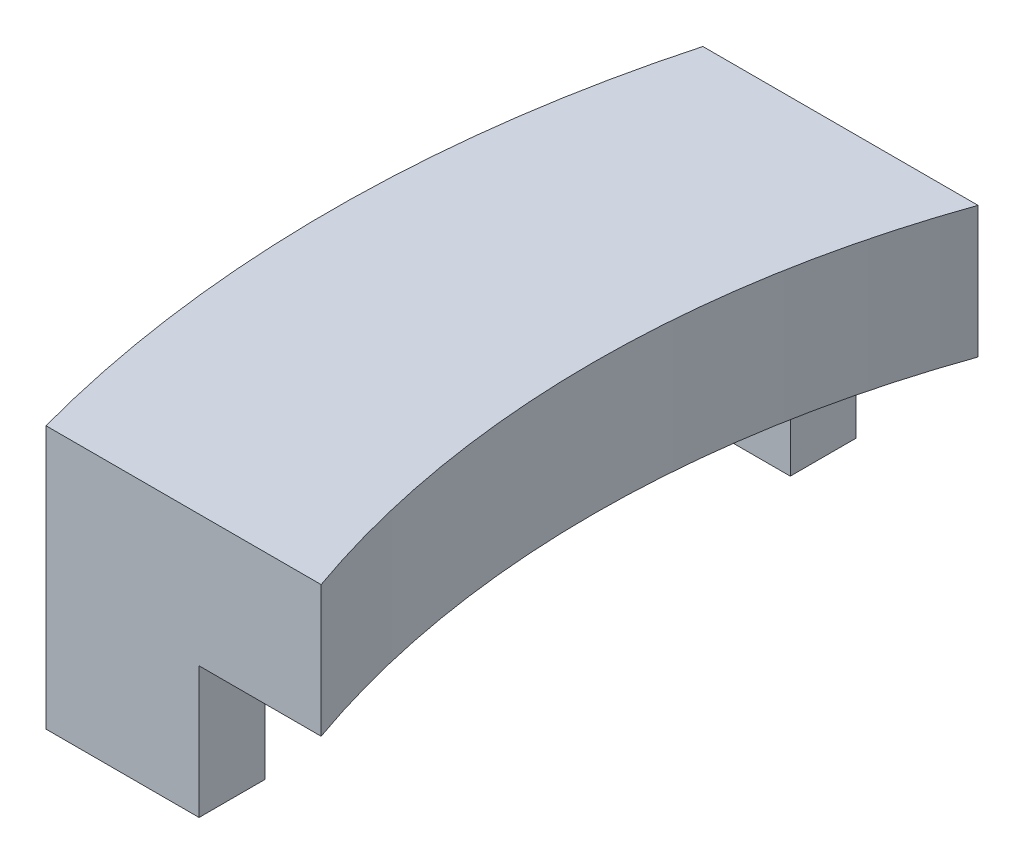
ISO-10303-21;
HEADER;
FILE_DESCRIPTION(('STEP AP214'),'2;1');
FILE_NAME('part.step','',(''),(''),'','','');
FILE_SCHEMA(('AUTOMOTIVE_DESIGN { 1 0 10303 214 1 1 1 1 }'));
ENDSEC;
DATA;
#1=APPLICATION_CONTEXT('core data for automotive mechanical design processes');
#2=APPLICATION_PROTOCOL_DEFINITION('international standard','automotive_design',2000,#1);
#3=PRODUCT_CONTEXT('',#1,'mechanical');
#4=PRODUCT('Part','Part','',(#3));
#5=PRODUCT_RELATED_PRODUCT_CATEGORY('part','',(#4));
#6=PRODUCT_DEFINITION_FORMATION('','',#4);
#7=PRODUCT_DEFINITION_CONTEXT('part definition',#1,'design');
#8=PRODUCT_DEFINITION('design','',#6,#7);
#9=PRODUCT_DEFINITION_SHAPE('','',#8);
#10=(LENGTH_UNIT() NAMED_UNIT(*) SI_UNIT(.MILLI.,.METRE.));
#11=(NAMED_UNIT(*) PLANE_ANGLE_UNIT() SI_UNIT($,.RADIAN.));
#12=(NAMED_UNIT(*) SI_UNIT($,.STERADIAN.) SOLID_ANGLE_UNIT());
#13=UNCERTAINTY_MEASURE_WITH_UNIT(LENGTH_MEASURE(1.E-05),#10,'distance_accuracy_value','');
#14=(GEOMETRIC_REPRESENTATION_CONTEXT(3) GLOBAL_UNCERTAINTY_ASSIGNED_CONTEXT((#13)) GLOBAL_UNIT_ASSIGNED_CONTEXT((#10,
#11,#12)) REPRESENTATION_CONTEXT('',''));
#15=CARTESIAN_POINT('',(0.,0.,0.));
#16=DIRECTION('',(0.,0.,1.));
#17=DIRECTION('',(1.,0.,0.));
#18=AXIS2_PLACEMENT_3D('',#15,#16,#17);
#19=CARTESIAN_POINT('',(0.,0.,0.));
#20=DIRECTION('',(0.,1.,0.));
#21=DIRECTION('',(0.,0.,1.));
#22=AXIS2_PLACEMENT_3D('',#19,#20,#21);
#23=PLANE('',#22);
#24=DIRECTION('',(0.,0.,1.));
#25=VECTOR('',#24,1.);
#26=CARTESIAN_POINT('',(-16.,0.,-4.));
#27=LINE('',#26,#25);
#28=CARTESIAN_POINT('',(-16.,0.,-5.));
#29=VERTEX_POINT('',#28);
#30=CARTESIAN_POINT('',(-16.,0.,-4.));
#31=VERTEX_POINT('',#30);
#32=EDGE_CURVE('E132',#29,#31,#27,.T.);
#33=ORIENTED_EDGE('',*,*,#32,.F.);
#34=DIRECTION('',(-1.,0.,0.));
#35=VECTOR('',#34,1.);
#36=CARTESIAN_POINT('',(-18.3303027798234,0.,-5.));
#37=LINE('',#36,#35);
#38=CARTESIAN_POINT('',(-14.142135623731,0.,-5.));
#39=VERTEX_POINT('',#38);
#40=EDGE_CURVE('E181',#39,#29,#37,.T.);
#41=ORIENTED_EDGE('',*,*,#40,.F.);
#42=CARTESIAN_POINT('',(0.,0.,0.));
#43=DIRECTION('',(0.,-1.,0.));
#44=DIRECTION('',(0.,0.,1.));
#45=AXIS2_PLACEMENT_3D('',#42,#43,#44);
#46=CIRCLE('',#45,15.);
#47=CARTESIAN_POINT('',(-14.142135623731,0.,5.));
#48=VERTEX_POINT('',#47);
#49=EDGE_CURVE('E168',#48,#39,#46,.T.);
#50=ORIENTED_EDGE('',*,*,#49,.F.);
#51=DIRECTION('',(1.,0.,0.));
#52=VECTOR('',#51,1.);
#53=CARTESIAN_POINT('',(-18.3303027798234,0.,5.));
#54=LINE('',#53,#52);
#55=CARTESIAN_POINT('',(-16.,0.,5.));
#56=VERTEX_POINT('',#55);
#57=EDGE_CURVE('E173',#56,#48,#54,.T.);
#58=ORIENTED_EDGE('',*,*,#57,.F.);
#59=DIRECTION('',(0.,0.,1.));
#60=VECTOR('',#59,1.);
#61=CARTESIAN_POINT('',(-16.,0.,5.));
#62=LINE('',#61,#60);
#63=CARTESIAN_POINT('',(-16.,0.,4.));
#64=VERTEX_POINT('',#63);
#65=EDGE_CURVE('E148',#64,#56,#62,.T.);
#66=ORIENTED_EDGE('',*,*,#65,.F.);
#67=DIRECTION('',(1.,0.,0.));
#68=VECTOR('',#67,1.);
#69=CARTESIAN_POINT('',(-18.5741756210067,0.,4.));
#70=LINE('',#69,#68);
#71=CARTESIAN_POINT('',(-18.5741756210067,0.,4.));
#72=VERTEX_POINT('',#71);
#73=EDGE_CURVE('E143',#72,#64,#70,.T.);
#74=ORIENTED_EDGE('',*,*,#73,.F.);
#75=CARTESIAN_POINT('',(0.,0.,0.));
#76=DIRECTION('',(0.,1.,0.));
#77=DIRECTION('',(0.,0.,1.));
#78=AXIS2_PLACEMENT_3D('',#75,#76,#77);
#79=CIRCLE('',#78,19.);
#80=CARTESIAN_POINT('',(-18.5741756210067,0.,-4.));
#81=VERTEX_POINT('',#80);
#82=EDGE_CURVE('E53',#81,#72,#79,.T.);
#83=ORIENTED_EDGE('',*,*,#82,.F.);
#84=DIRECTION('',(-1.,0.,0.));
#85=VECTOR('',#84,1.);
#86=CARTESIAN_POINT('',(-18.5741756210067,0.,-4.));
#87=LINE('',#86,#85);
#88=EDGE_CURVE('E130',#31,#81,#87,.T.);
#89=ORIENTED_EDGE('',*,*,#88,.F.);
#90=EDGE_LOOP('',(#33,#41,#50,#58,#66,#74,#83,#89));
#91=FACE_BOUND('',#90,.T.);
#92=ADVANCED_FACE('F33',(#91),#23,.F.);
#93=CARTESIAN_POINT('',(0.,2.,0.));
#94=DIRECTION('',(0.,-1.,0.));
#95=DIRECTION('',(0.,0.,-1.));
#96=AXIS2_PLACEMENT_3D('',#93,#94,#95);
#97=CYLINDRICAL_SURFACE('',#96,15.);
#98=ORIENTED_EDGE('',*,*,#49,.T.);
#99=DIRECTION('',(0.,-1.,0.));
#100=VECTOR('',#99,1.);
#101=CARTESIAN_POINT('',(-14.142135623731,2.,-5.));
#102=LINE('',#101,#100);
#103=CARTESIAN_POINT('',(-14.142135623731,2.,-5.));
#104=VERTEX_POINT('',#103);
#105=EDGE_CURVE('E11',#104,#39,#102,.T.);
#106=ORIENTED_EDGE('',*,*,#105,.F.);
#107=CARTESIAN_POINT('',(0.,2.,0.));
#108=DIRECTION('',(0.,-1.,0.));
#109=DIRECTION('',(0.,0.,1.));
#110=AXIS2_PLACEMENT_3D('',#107,#108,#109);
#111=CIRCLE('',#110,15.);
#112=CARTESIAN_POINT('',(-14.142135623731,2.,5.));
#113=VERTEX_POINT('',#112);
#114=EDGE_CURVE('E169',#113,#104,#111,.T.);
#115=ORIENTED_EDGE('',*,*,#114,.F.);
#116=DIRECTION('',(0.,-1.,0.));
#117=VECTOR('',#116,1.);
#118=CARTESIAN_POINT('',(-14.142135623731,2.,5.));
#119=LINE('',#118,#117);
#120=EDGE_CURVE('E178',#113,#48,#119,.T.);
#121=ORIENTED_EDGE('',*,*,#120,.T.);
#122=EDGE_LOOP('',(#98,#106,#115,#121));
#123=FACE_BOUND('',#122,.T.);
#124=ADVANCED_FACE('F35',(#123),#97,.F.);
#125=CARTESIAN_POINT('',(-18.3303027798234,2.,-5.));
#126=DIRECTION('',(0.,0.,1.));
#127=DIRECTION('',(1.,0.,0.));
#128=AXIS2_PLACEMENT_3D('',#125,#126,#127);
#129=PLANE('',#128);
#130=ORIENTED_EDGE('',*,*,#40,.T.);
#131=DIRECTION('',(0.,1.,0.));
#132=VECTOR('',#131,1.);
#133=CARTESIAN_POINT('',(-16.,-2.,-5.));
#134=LINE('',#133,#132);
#135=CARTESIAN_POINT('',(-16.,-2.,-5.));
#136=VERTEX_POINT('',#135);
#137=EDGE_CURVE('E122',#136,#29,#134,.T.);
#138=ORIENTED_EDGE('',*,*,#137,.F.);
#139=DIRECTION('',(1.,0.,0.));
#140=VECTOR('',#139,1.);
#141=CARTESIAN_POINT('',(-16.,-2.,-5.));
#142=LINE('',#141,#140);
#143=CARTESIAN_POINT('',(-18.3303027798234,-2.,-5.));
#144=VERTEX_POINT('',#143);
#145=EDGE_CURVE('E119',#144,#136,#142,.T.);
#146=ORIENTED_EDGE('',*,*,#145,.F.);
#147=DIRECTION('',(0.,-1.,0.));
#148=VECTOR('',#147,1.);
#149=CARTESIAN_POINT('',(-18.3303027798234,2.,-5.));
#150=LINE('',#149,#148);
#151=CARTESIAN_POINT('',(-18.3303027798234,2.,-5.));
#152=VERTEX_POINT('',#151);
#153=EDGE_CURVE('E41',#152,#144,#150,.T.);
#154=ORIENTED_EDGE('',*,*,#153,.F.);
#155=DIRECTION('',(-1.,0.,0.));
#156=VECTOR('',#155,1.);
#157=CARTESIAN_POINT('',(-18.3303027798234,2.,-5.));
#158=LINE('',#157,#156);
#159=EDGE_CURVE('E172',#104,#152,#158,.T.);
#160=ORIENTED_EDGE('',*,*,#159,.F.);
#161=ORIENTED_EDGE('',*,*,#105,.T.);
#162=EDGE_LOOP('',(#130,#138,#146,#154,#160,#161));
#163=FACE_BOUND('',#162,.T.);
#164=ADVANCED_FACE('F121',(#163),#129,.F.);
#165=CARTESIAN_POINT('',(0.,2.,0.));
#166=DIRECTION('',(0.,-1.,0.));
#167=DIRECTION('',(0.,0.,-1.));
#168=AXIS2_PLACEMENT_3D('',#165,#166,#167);
#169=CYLINDRICAL_SURFACE('',#168,19.);
#170=ORIENTED_EDGE('',*,*,#153,.T.);
#171=CARTESIAN_POINT('',(0.,-2.,0.));
#172=DIRECTION('',(0.,-1.,0.));
#173=DIRECTION('',(0.,0.,-1.));
#174=AXIS2_PLACEMENT_3D('',#171,#172,#173);
#175=CIRCLE('',#174,19.);
#176=CARTESIAN_POINT('',(-18.5741756210067,-2.,-4.));
#177=VERTEX_POINT('',#176);
#178=EDGE_CURVE('E113',#177,#144,#175,.T.);
#179=ORIENTED_EDGE('',*,*,#178,.F.);
#180=DIRECTION('',(0.,1.,0.));
#181=VECTOR('',#180,1.);
#182=CARTESIAN_POINT('',(-18.5741756210067,-2.,-4.));
#183=LINE('',#182,#181);
#184=EDGE_CURVE('E48',#177,#81,#183,.T.);
#185=ORIENTED_EDGE('',*,*,#184,.T.);
#186=ORIENTED_EDGE('',*,*,#82,.T.);
#187=DIRECTION('',(0.,1.,0.));
#188=VECTOR('',#187,1.);
#189=CARTESIAN_POINT('',(-18.5741756210067,-2.,4.));
#190=LINE('',#189,#188);
#191=CARTESIAN_POINT('',(-18.5741756210067,-2.,4.));
#192=VERTEX_POINT('',#191);
#193=EDGE_CURVE('E165',#192,#72,#190,.T.);
#194=ORIENTED_EDGE('',*,*,#193,.F.);
#195=CARTESIAN_POINT('',(0.,-2.,0.));
#196=DIRECTION('',(0.,-1.,0.));
#197=DIRECTION('',(0.,0.,-1.));
#198=AXIS2_PLACEMENT_3D('',#195,#196,#197);
#199=CIRCLE('',#198,19.);
#200=CARTESIAN_POINT('',(-18.3303027798234,-2.,5.));
#201=VERTEX_POINT('',#200);
#202=EDGE_CURVE('E144',#201,#192,#199,.T.);
#203=ORIENTED_EDGE('',*,*,#202,.F.);
#204=DIRECTION('',(0.,-1.,0.));
#205=VECTOR('',#204,1.);
#206=CARTESIAN_POINT('',(-18.3303027798234,2.,5.));
#207=LINE('',#206,#205);
#208=CARTESIAN_POINT('',(-18.3303027798234,2.,5.));
#209=VERTEX_POINT('',#208);
#210=EDGE_CURVE('E117',#209,#201,#207,.T.);
#211=ORIENTED_EDGE('',*,*,#210,.F.);
#212=CARTESIAN_POINT('',(0.,2.,0.));
#213=DIRECTION('',(0.,1.,0.));
#214=DIRECTION('',(0.,0.,1.));
#215=AXIS2_PLACEMENT_3D('',#212,#213,#214);
#216=CIRCLE('',#215,19.);
#217=EDGE_CURVE('E115',#152,#209,#216,.T.);
#218=ORIENTED_EDGE('',*,*,#217,.F.);
#219=EDGE_LOOP('',(#170,#179,#185,#186,#194,#203,#211,#218));
#220=FACE_BOUND('',#219,.T.);
#221=ADVANCED_FACE('F111',(#220),#169,.T.);
#222=CARTESIAN_POINT('',(-18.3303027798234,2.,5.));
#223=DIRECTION('',(0.,0.,-1.));
#224=DIRECTION('',(-1.,0.,0.));
#225=AXIS2_PLACEMENT_3D('',#222,#223,#224);
#226=PLANE('',#225);
#227=ORIENTED_EDGE('',*,*,#210,.T.);
#228=DIRECTION('',(-1.,0.,0.));
#229=VECTOR('',#228,1.);
#230=CARTESIAN_POINT('',(-18.3303027798234,-2.,5.));
#231=LINE('',#230,#229);
#232=CARTESIAN_POINT('',(-16.,-2.,5.));
#233=VERTEX_POINT('',#232);
#234=EDGE_CURVE('E152',#233,#201,#231,.T.);
#235=ORIENTED_EDGE('',*,*,#234,.F.);
#236=DIRECTION('',(0.,1.,0.));
#237=VECTOR('',#236,1.);
#238=CARTESIAN_POINT('',(-16.,-2.,5.));
#239=LINE('',#238,#237);
#240=EDGE_CURVE('E155',#233,#56,#239,.T.);
#241=ORIENTED_EDGE('',*,*,#240,.T.);
#242=ORIENTED_EDGE('',*,*,#57,.T.);
#243=ORIENTED_EDGE('',*,*,#120,.F.);
#244=DIRECTION('',(1.,0.,0.));
#245=VECTOR('',#244,1.);
#246=CARTESIAN_POINT('',(-18.3303027798234,2.,5.));
#247=LINE('',#246,#245);
#248=EDGE_CURVE('E176',#209,#113,#247,.T.);
#249=ORIENTED_EDGE('',*,*,#248,.F.);
#250=EDGE_LOOP('',(#227,#235,#241,#242,#243,#249));
#251=FACE_BOUND('',#250,.T.);
#252=ADVANCED_FACE('F190',(#251),#226,.F.);
#253=CARTESIAN_POINT('',(0.,2.,0.));
#254=DIRECTION('',(0.,1.,0.));
#255=DIRECTION('',(0.,0.,1.));
#256=AXIS2_PLACEMENT_3D('',#253,#254,#255);
#257=PLANE('',#256);
#258=ORIENTED_EDGE('',*,*,#114,.T.);
#259=ORIENTED_EDGE('',*,*,#159,.T.);
#260=ORIENTED_EDGE('',*,*,#217,.T.);
#261=ORIENTED_EDGE('',*,*,#248,.T.);
#262=EDGE_LOOP('',(#258,#259,#260,#261));
#263=FACE_BOUND('',#262,.T.);
#264=ADVANCED_FACE('F210',(#263),#257,.T.);
#265=CARTESIAN_POINT('',(-18.5741756210067,-2.,4.));
#266=DIRECTION('',(0.,0.,1.));
#267=DIRECTION('',(1.,0.,0.));
#268=AXIS2_PLACEMENT_3D('',#265,#266,#267);
#269=PLANE('',#268);
#270=ORIENTED_EDGE('',*,*,#73,.T.);
#271=DIRECTION('',(0.,1.,0.));
#272=VECTOR('',#271,1.);
#273=CARTESIAN_POINT('',(-16.,-2.,4.));
#274=LINE('',#273,#272);
#275=CARTESIAN_POINT('',(-16.,-2.,4.));
#276=VERTEX_POINT('',#275);
#277=EDGE_CURVE('E162',#276,#64,#274,.T.);
#278=ORIENTED_EDGE('',*,*,#277,.F.);
#279=DIRECTION('',(1.,0.,0.));
#280=VECTOR('',#279,1.);
#281=CARTESIAN_POINT('',(-18.5741756210067,-2.,4.));
#282=LINE('',#281,#280);
#283=EDGE_CURVE('E147',#192,#276,#282,.T.);
#284=ORIENTED_EDGE('',*,*,#283,.F.);
#285=ORIENTED_EDGE('',*,*,#193,.T.);
#286=EDGE_LOOP('',(#270,#278,#284,#285));
#287=FACE_BOUND('',#286,.T.);
#288=ADVANCED_FACE('F198',(#287),#269,.F.);
#289=CARTESIAN_POINT('',(-16.,-2.,5.));
#290=DIRECTION('',(-1.,0.,0.));
#291=DIRECTION('',(0.,0.,1.));
#292=AXIS2_PLACEMENT_3D('',#289,#290,#291);
#293=PLANE('',#292);
#294=ORIENTED_EDGE('',*,*,#65,.T.);
#295=ORIENTED_EDGE('',*,*,#240,.F.);
#296=DIRECTION('',(0.,0.,1.));
#297=VECTOR('',#296,1.);
#298=CARTESIAN_POINT('',(-16.,-2.,5.));
#299=LINE('',#298,#297);
#300=EDGE_CURVE('E150',#276,#233,#299,.T.);
#301=ORIENTED_EDGE('',*,*,#300,.F.);
#302=ORIENTED_EDGE('',*,*,#277,.T.);
#303=EDGE_LOOP('',(#294,#295,#301,#302));
#304=FACE_BOUND('',#303,.T.);
#305=ADVANCED_FACE('F201',(#304),#293,.F.);
#306=CARTESIAN_POINT('',(0.,-2.,0.));
#307=DIRECTION('',(0.,-1.,0.));
#308=DIRECTION('',(0.,0.,-1.));
#309=AXIS2_PLACEMENT_3D('',#306,#307,#308);
#310=PLANE('',#309);
#311=ORIENTED_EDGE('',*,*,#202,.T.);
#312=ORIENTED_EDGE('',*,*,#283,.T.);
#313=ORIENTED_EDGE('',*,*,#300,.T.);
#314=ORIENTED_EDGE('',*,*,#234,.T.);
#315=EDGE_LOOP('',(#311,#312,#313,#314));
#316=FACE_BOUND('',#315,.T.);
#317=ADVANCED_FACE('F194',(#316),#310,.T.);
#318=CARTESIAN_POINT('',(-16.,-2.,-4.));
#319=DIRECTION('',(-1.,0.,0.));
#320=DIRECTION('',(0.,0.,1.));
#321=AXIS2_PLACEMENT_3D('',#318,#319,#320);
#322=PLANE('',#321);
#323=ORIENTED_EDGE('',*,*,#32,.T.);
#324=DIRECTION('',(0.,1.,0.));
#325=VECTOR('',#324,1.);
#326=CARTESIAN_POINT('',(-16.,-2.,-4.));
#327=LINE('',#326,#325);
#328=CARTESIAN_POINT('',(-16.,-2.,-4.));
#329=VERTEX_POINT('',#328);
#330=EDGE_CURVE('E139',#329,#31,#327,.T.);
#331=ORIENTED_EDGE('',*,*,#330,.F.);
#332=DIRECTION('',(0.,0.,1.));
#333=VECTOR('',#332,1.);
#334=CARTESIAN_POINT('',(-16.,-2.,-4.));
#335=LINE('',#334,#333);
#336=EDGE_CURVE('E125',#136,#329,#335,.T.);
#337=ORIENTED_EDGE('',*,*,#336,.F.);
#338=ORIENTED_EDGE('',*,*,#137,.T.);
#339=EDGE_LOOP('',(#323,#331,#337,#338));
#340=FACE_BOUND('',#339,.T.);
#341=ADVANCED_FACE('F263',(#340),#322,.F.);
#342=CARTESIAN_POINT('',(-18.5741756210067,-2.,-4.));
#343=DIRECTION('',(0.,0.,-1.));
#344=DIRECTION('',(-1.,0.,0.));
#345=AXIS2_PLACEMENT_3D('',#342,#343,#344);
#346=PLANE('',#345);
#347=ORIENTED_EDGE('',*,*,#88,.T.);
#348=ORIENTED_EDGE('',*,*,#184,.F.);
#349=DIRECTION('',(-1.,0.,0.));
#350=VECTOR('',#349,1.);
#351=CARTESIAN_POINT('',(-18.5741756210067,-2.,-4.));
#352=LINE('',#351,#350);
#353=EDGE_CURVE('E129',#329,#177,#352,.T.);
#354=ORIENTED_EDGE('',*,*,#353,.F.);
#355=ORIENTED_EDGE('',*,*,#330,.T.);
#356=EDGE_LOOP('',(#347,#348,#354,#355));
#357=FACE_BOUND('',#356,.T.);
#358=ADVANCED_FACE('F272',(#357),#346,.F.);
#359=CARTESIAN_POINT('',(0.,-2.,0.));
#360=DIRECTION('',(0.,-1.,0.));
#361=DIRECTION('',(0.,0.,-1.));
#362=AXIS2_PLACEMENT_3D('',#359,#360,#361);
#363=PLANE('',#362);
#364=ORIENTED_EDGE('',*,*,#178,.T.);
#365=ORIENTED_EDGE('',*,*,#145,.T.);
#366=ORIENTED_EDGE('',*,*,#336,.T.);
#367=ORIENTED_EDGE('',*,*,#353,.T.);
#368=EDGE_LOOP('',(#364,#365,#366,#367));
#369=FACE_BOUND('',#368,.T.);
#370=ADVANCED_FACE('F127',(#369),#363,.T.);
#371=CLOSED_SHELL('',(#92,#124,#164,#221,#252,#264,#288,#305,#317,#341,#358,#370));
#372=MANIFOLD_SOLID_BREP('B2',#371);
#373=ADVANCED_BREP_SHAPE_REPRESENTATION('',(#18,#372),#14);
#374=SHAPE_DEFINITION_REPRESENTATION(#9,#373);
ENDSEC;
END-ISO-10303-21;
